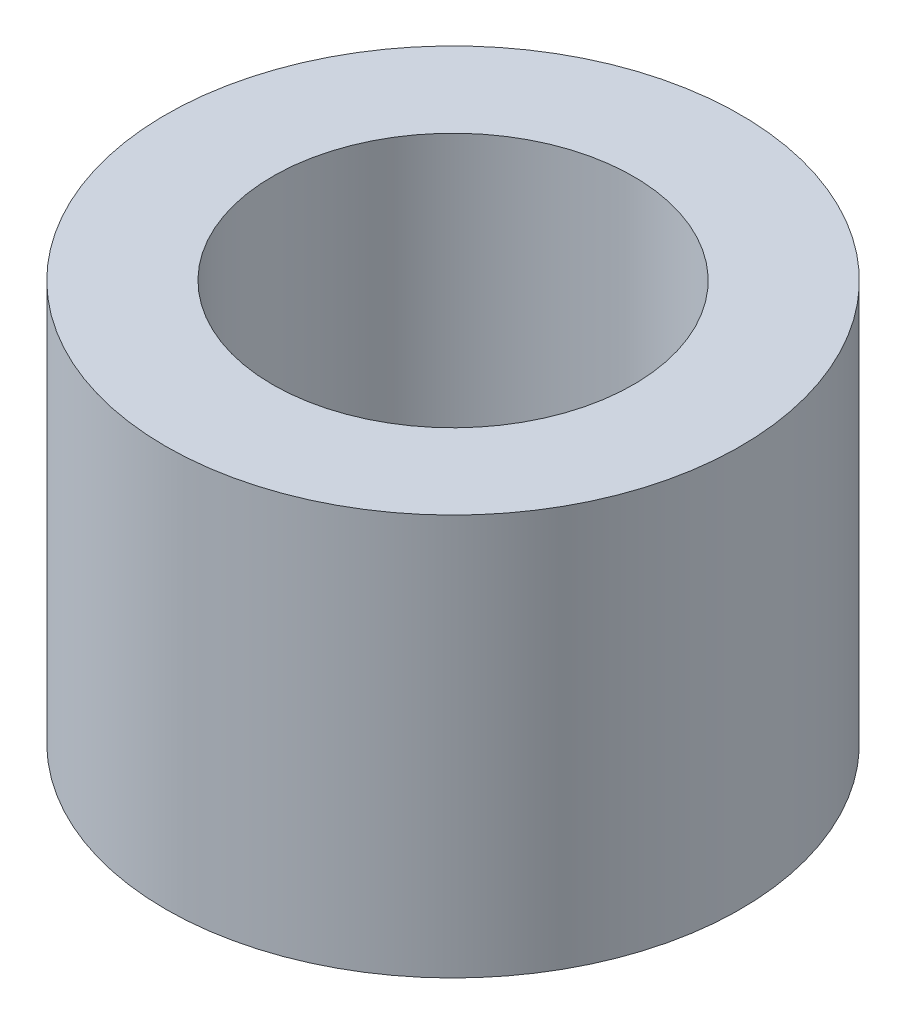
ISO-10303-21;
HEADER;
FILE_DESCRIPTION(('STEP AP214'),'2;1');
FILE_NAME('part.step','',(''),(''),'','','');
FILE_SCHEMA(('AUTOMOTIVE_DESIGN { 1 0 10303 214 1 1 1 1 }'));
ENDSEC;
DATA;
#1=APPLICATION_CONTEXT('core data for automotive mechanical design processes');
#2=APPLICATION_PROTOCOL_DEFINITION('international standard','automotive_design',2000,#1);
#3=PRODUCT_CONTEXT('',#1,'mechanical');
#4=PRODUCT('Part','Part','',(#3));
#5=PRODUCT_RELATED_PRODUCT_CATEGORY('part','',(#4));
#6=PRODUCT_DEFINITION_FORMATION('','',#4);
#7=PRODUCT_DEFINITION_CONTEXT('part definition',#1,'design');
#8=PRODUCT_DEFINITION('design','',#6,#7);
#9=PRODUCT_DEFINITION_SHAPE('','',#8);
#10=(LENGTH_UNIT() NAMED_UNIT(*) SI_UNIT(.MILLI.,.METRE.));
#11=(NAMED_UNIT(*) PLANE_ANGLE_UNIT() SI_UNIT($,.RADIAN.));
#12=(NAMED_UNIT(*) SI_UNIT($,.STERADIAN.) SOLID_ANGLE_UNIT());
#13=UNCERTAINTY_MEASURE_WITH_UNIT(LENGTH_MEASURE(1.E-05),#10,'distance_accuracy_value','');
#14=(GEOMETRIC_REPRESENTATION_CONTEXT(3) GLOBAL_UNCERTAINTY_ASSIGNED_CONTEXT((#13)) GLOBAL_UNIT_ASSIGNED_CONTEXT((#10,
#11,#12)) REPRESENTATION_CONTEXT('',''));
#15=CARTESIAN_POINT('',(0.,0.,0.));
#16=DIRECTION('',(0.,0.,1.));
#17=DIRECTION('',(1.,0.,0.));
#18=AXIS2_PLACEMENT_3D('',#15,#16,#17);
#19=CARTESIAN_POINT('',(0.,150.,0.));
#20=DIRECTION('',(0.,-1.,0.));
#21=DIRECTION('',(0.,0.,-1.));
#22=AXIS2_PLACEMENT_3D('',#19,#20,#21);
#23=CYLINDRICAL_SURFACE('',#22,107.5);
#24=CARTESIAN_POINT('',(0.,150.,0.));
#25=DIRECTION('',(0.,1.,0.));
#26=DIRECTION('',(0.,0.,1.));
#27=AXIS2_PLACEMENT_3D('',#24,#25,#26);
#28=CIRCLE('',#27,107.5);
#29=CARTESIAN_POINT('',(0.,150.,107.5));
#30=VERTEX_POINT('',#29);
#31=EDGE_CURVE('E10',#30,#30,#28,.T.);
#32=ORIENTED_EDGE('',*,*,#31,.F.);
#33=EDGE_LOOP('',(#32));
#34=FACE_BOUND('',#33,.T.);
#35=CARTESIAN_POINT('',(0.,0.,0.));
#36=DIRECTION('',(0.,1.,0.));
#37=DIRECTION('',(0.,0.,1.));
#38=AXIS2_PLACEMENT_3D('',#35,#36,#37);
#39=CIRCLE('',#38,107.5);
#40=CARTESIAN_POINT('',(0.,0.,107.5));
#41=VERTEX_POINT('',#40);
#42=EDGE_CURVE('E40',#41,#41,#39,.T.);
#43=ORIENTED_EDGE('',*,*,#42,.T.);
#44=EDGE_LOOP('',(#43));
#45=FACE_BOUND('',#44,.T.);
#46=ADVANCED_FACE('F37',(#34,#45),#23,.T.);
#47=CARTESIAN_POINT('',(0.,150.,0.));
#48=DIRECTION('',(0.,1.,0.));
#49=DIRECTION('',(0.,0.,1.));
#50=AXIS2_PLACEMENT_3D('',#47,#48,#49);
#51=PLANE('',#50);
#52=CARTESIAN_POINT('',(0.,150.,0.));
#53=DIRECTION('',(0.,1.,0.));
#54=DIRECTION('',(0.,0.,1.));
#55=AXIS2_PLACEMENT_3D('',#52,#53,#54);
#56=CIRCLE('',#55,67.5);
#57=CARTESIAN_POINT('',(0.,150.,67.5));
#58=VERTEX_POINT('',#57);
#59=EDGE_CURVE('E51',#58,#58,#56,.T.);
#60=ORIENTED_EDGE('',*,*,#59,.F.);
#61=EDGE_LOOP('',(#60));
#62=FACE_BOUND('',#61,.T.);
#63=ORIENTED_EDGE('',*,*,#31,.T.);
#64=EDGE_LOOP('',(#63));
#65=FACE_BOUND('',#64,.T.);
#66=ADVANCED_FACE('F68',(#62,#65),#51,.T.);
#67=CARTESIAN_POINT('',(0.,0.,0.));
#68=DIRECTION('',(0.,1.,0.));
#69=DIRECTION('',(0.,0.,1.));
#70=AXIS2_PLACEMENT_3D('',#67,#68,#69);
#71=PLANE('',#70);
#72=CARTESIAN_POINT('',(0.,0.,0.));
#73=DIRECTION('',(0.,1.,0.));
#74=DIRECTION('',(0.,0.,1.));
#75=AXIS2_PLACEMENT_3D('',#72,#73,#74);
#76=CIRCLE('',#75,67.5);
#77=CARTESIAN_POINT('',(0.,0.,67.5));
#78=VERTEX_POINT('',#77);
#79=EDGE_CURVE('E49',#78,#78,#76,.T.);
#80=ORIENTED_EDGE('',*,*,#79,.T.);
#81=EDGE_LOOP('',(#80));
#82=FACE_BOUND('',#81,.T.);
#83=ORIENTED_EDGE('',*,*,#42,.F.);
#84=EDGE_LOOP('',(#83));
#85=FACE_BOUND('',#84,.T.);
#86=ADVANCED_FACE('F59',(#82,#85),#71,.F.);
#87=CARTESIAN_POINT('',(0.,0.,0.));
#88=DIRECTION('',(0.,1.,0.));
#89=DIRECTION('',(0.,0.,1.));
#90=AXIS2_PLACEMENT_3D('',#87,#88,#89);
#91=CYLINDRICAL_SURFACE('',#90,67.5);
#92=ORIENTED_EDGE('',*,*,#79,.F.);
#93=EDGE_LOOP('',(#92));
#94=FACE_BOUND('',#93,.T.);
#95=ORIENTED_EDGE('',*,*,#59,.T.);
#96=EDGE_LOOP('',(#95));
#97=FACE_BOUND('',#96,.T.);
#98=ADVANCED_FACE('F62',(#94,#97),#91,.F.);
#99=CLOSED_SHELL('',(#46,#66,#86,#98));
#100=MANIFOLD_SOLID_BREP('B2',#99);
#101=ADVANCED_BREP_SHAPE_REPRESENTATION('',(#18,#100),#14);
#102=SHAPE_DEFINITION_REPRESENTATION(#9,#101);
ENDSEC;
END-ISO-10303-21;
